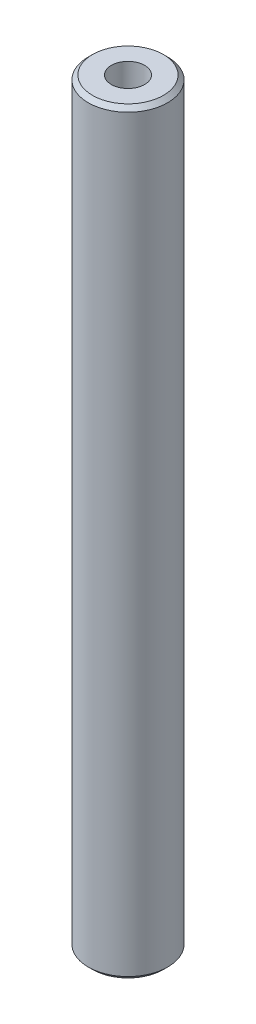
ISO-10303-21;
HEADER;
FILE_DESCRIPTION(('STEP AP214'),'2;1');
FILE_NAME('part.step','',(''),(''),'','','');
FILE_SCHEMA(('AUTOMOTIVE_DESIGN { 1 0 10303 214 1 1 1 1 }'));
ENDSEC;
DATA;
#1=APPLICATION_CONTEXT('core data for automotive mechanical design processes');
#2=APPLICATION_PROTOCOL_DEFINITION('international standard','automotive_design',2000,#1);
#3=PRODUCT_CONTEXT('',#1,'mechanical');
#4=PRODUCT('Part','Part','',(#3));
#5=PRODUCT_RELATED_PRODUCT_CATEGORY('part','',(#4));
#6=PRODUCT_DEFINITION_FORMATION('','',#4);
#7=PRODUCT_DEFINITION_CONTEXT('part definition',#1,'design');
#8=PRODUCT_DEFINITION('design','',#6,#7);
#9=PRODUCT_DEFINITION_SHAPE('','',#8);
#10=(LENGTH_UNIT() NAMED_UNIT(*) SI_UNIT(.MILLI.,.METRE.));
#11=(NAMED_UNIT(*) PLANE_ANGLE_UNIT() SI_UNIT($,.RADIAN.));
#12=(NAMED_UNIT(*) SI_UNIT($,.STERADIAN.) SOLID_ANGLE_UNIT());
#13=UNCERTAINTY_MEASURE_WITH_UNIT(LENGTH_MEASURE(1.E-05),#10,'distance_accuracy_value','');
#14=(GEOMETRIC_REPRESENTATION_CONTEXT(3) GLOBAL_UNCERTAINTY_ASSIGNED_CONTEXT((#13)) GLOBAL_UNIT_ASSIGNED_CONTEXT((#10,
#11,#12)) REPRESENTATION_CONTEXT('',''));
#15=CARTESIAN_POINT('',(0.,0.,0.));
#16=DIRECTION('',(0.,0.,1.));
#17=DIRECTION('',(1.,0.,0.));
#18=AXIS2_PLACEMENT_3D('',#15,#16,#17);
#19=CARTESIAN_POINT('',(0.,190.707714154887,0.));
#20=DIRECTION('',(0.,-1.,0.));
#21=DIRECTION('',(0.,0.,-1.));
#22=AXIS2_PLACEMENT_3D('',#19,#20,#21);
#23=CYLINDRICAL_SURFACE('',#22,10.);
#24=CARTESIAN_POINT('',(0.,189.637403917708,0.));
#25=DIRECTION('',(0.,1.,0.));
#26=DIRECTION('',(0.,0.,1.));
#27=AXIS2_PLACEMENT_3D('',#24,#25,#26);
#28=CIRCLE('',#27,10.);
#29=CARTESIAN_POINT('',(0.,189.637403917708,10.));
#30=VERTEX_POINT('',#29);
#31=EDGE_CURVE('E50',#30,#30,#28,.F.);
#32=ORIENTED_EDGE('',*,*,#31,.T.);
#33=EDGE_LOOP('',(#32));
#34=FACE_BOUND('',#33,.T.);
#35=CARTESIAN_POINT('',(0.,1.07031023717846,0.));
#36=DIRECTION('',(0.,1.,0.));
#37=DIRECTION('',(0.,0.,1.));
#38=AXIS2_PLACEMENT_3D('',#35,#36,#37);
#39=CIRCLE('',#38,10.);
#40=CARTESIAN_POINT('',(0.,1.07031023717846,10.));
#41=VERTEX_POINT('',#40);
#42=EDGE_CURVE('E51',#41,#41,#39,.T.);
#43=ORIENTED_EDGE('',*,*,#42,.T.);
#44=EDGE_LOOP('',(#43));
#45=FACE_BOUND('',#44,.T.);
#46=ADVANCED_FACE('F39',(#34,#45),#23,.T.);
#47=CARTESIAN_POINT('',(0.,190.707714154887,0.));
#48=DIRECTION('',(0.,1.,0.));
#49=DIRECTION('',(0.,0.,1.));
#50=AXIS2_PLACEMENT_3D('',#47,#48,#49);
#51=PLANE('',#50);
#52=CARTESIAN_POINT('',(0.,190.707714154887,0.));
#53=DIRECTION('',(0.,1.,0.));
#54=DIRECTION('',(0.,0.,1.));
#55=AXIS2_PLACEMENT_3D('',#52,#53,#54);
#56=CIRCLE('',#55,8.92968976282157);
#57=CARTESIAN_POINT('',(0.,190.707714154887,8.92968976282157));
#58=VERTEX_POINT('',#57);
#59=EDGE_CURVE('E54',#58,#58,#56,.T.);
#60=ORIENTED_EDGE('',*,*,#59,.T.);
#61=EDGE_LOOP('',(#60));
#62=FACE_BOUND('',#61,.T.);
#63=CARTESIAN_POINT('',(0.,190.707714154887,0.));
#64=DIRECTION('',(0.,1.,0.));
#65=DIRECTION('',(0.,0.,1.));
#66=AXIS2_PLACEMENT_3D('',#63,#64,#65);
#67=CIRCLE('',#66,4.19323574440019);
#68=CARTESIAN_POINT('',(0.,190.707714154887,4.19323574440019));
#69=VERTEX_POINT('',#68);
#70=EDGE_CURVE('E58',#69,#69,#67,.T.);
#71=ORIENTED_EDGE('',*,*,#70,.F.);
#72=EDGE_LOOP('',(#71));
#73=FACE_BOUND('',#72,.T.);
#74=ADVANCED_FACE('F69',(#62,#73),#51,.T.);
#75=CARTESIAN_POINT('',(0.,0.,0.));
#76=DIRECTION('',(0.,1.,0.));
#77=DIRECTION('',(0.,0.,1.));
#78=AXIS2_PLACEMENT_3D('',#75,#76,#77);
#79=PLANE('',#78);
#80=CARTESIAN_POINT('',(0.,0.,0.));
#81=DIRECTION('',(0.,1.,0.));
#82=DIRECTION('',(0.,0.,1.));
#83=AXIS2_PLACEMENT_3D('',#80,#81,#82);
#84=CIRCLE('',#83,8.92968976282152);
#85=CARTESIAN_POINT('',(0.,0.,8.92968976282152));
#86=VERTEX_POINT('',#85);
#87=EDGE_CURVE('E10',#86,#86,#84,.F.);
#88=ORIENTED_EDGE('',*,*,#87,.T.);
#89=EDGE_LOOP('',(#88));
#90=FACE_BOUND('',#89,.T.);
#91=CARTESIAN_POINT('',(0.,0.,0.));
#92=DIRECTION('',(0.,1.,0.));
#93=DIRECTION('',(0.,0.,1.));
#94=AXIS2_PLACEMENT_3D('',#91,#92,#93);
#95=CIRCLE('',#94,4.19323574440019);
#96=CARTESIAN_POINT('',(0.,0.,4.19323574440019));
#97=VERTEX_POINT('',#96);
#98=EDGE_CURVE('E63',#97,#97,#95,.T.);
#99=ORIENTED_EDGE('',*,*,#98,.T.);
#100=EDGE_LOOP('',(#99));
#101=FACE_BOUND('',#100,.T.);
#102=ADVANCED_FACE('F75',(#90,#101),#79,.F.);
#103=CARTESIAN_POINT('',(0.,190.707714154887,0.));
#104=DIRECTION('',(0.,-1.,0.));
#105=DIRECTION('',(0.,0.,-1.));
#106=AXIS2_PLACEMENT_3D('',#103,#104,#105);
#107=CYLINDRICAL_SURFACE('',#106,4.19323574440019);
#108=ORIENTED_EDGE('',*,*,#70,.T.);
#109=EDGE_LOOP('',(#108));
#110=FACE_BOUND('',#109,.T.);
#111=ORIENTED_EDGE('',*,*,#98,.F.);
#112=EDGE_LOOP('',(#111));
#113=FACE_BOUND('',#112,.T.);
#114=ADVANCED_FACE('F70',(#110,#113),#107,.F.);
#115=CARTESIAN_POINT('',(0.,190.707714154887,0.));
#116=DIRECTION('',(0.,-1.,0.));
#117=DIRECTION('',(0.,0.,-1.));
#118=AXIS2_PLACEMENT_3D('',#115,#116,#117);
#119=CONICAL_SURFACE('',#118,8.92968976282157,0.785398163397444);
#120=ORIENTED_EDGE('',*,*,#31,.F.);
#121=EDGE_LOOP('',(#120));
#122=FACE_BOUND('',#121,.T.);
#123=ORIENTED_EDGE('',*,*,#59,.F.);
#124=EDGE_LOOP('',(#123));
#125=FACE_BOUND('',#124,.T.);
#126=ADVANCED_FACE('F81',(#122,#125),#119,.T.);
#127=CARTESIAN_POINT('',(0.,1.07031023717846,0.));
#128=DIRECTION('',(0.,1.,0.));
#129=DIRECTION('',(0.,0.,1.));
#130=AXIS2_PLACEMENT_3D('',#127,#128,#129);
#131=CONICAL_SURFACE('',#130,10.,0.785398163397457);
#132=CARTESIAN_POINT('',(0.,0.,8.92968976282152));
#133=CARTESIAN_POINT('',(0.,0.0111490649706086,8.94083882779213));
#134=CARTESIAN_POINT('',(0.,0.0222981299412177,8.95198789276274));
#135=CARTESIAN_POINT('',(0.,0.0445962598824358,8.97428602270396));
#136=CARTESIAN_POINT('',(0.,0.0557453248530449,8.98543508767456));
#137=CARTESIAN_POINT('',(0.,0.0780434547942627,9.00773321761578));
#138=CARTESIAN_POINT('',(0.,0.0891925197648715,9.01888228258639));
#139=CARTESIAN_POINT('',(0.,0.111490649706089,9.04118041252761));
#140=CARTESIAN_POINT('',(0.,0.122639714676698,9.05232947749822));
#141=CARTESIAN_POINT('',(0.,0.144937844617917,9.07462760743944));
#142=CARTESIAN_POINT('',(0.,0.156086909588526,9.08577667241005));
#143=CARTESIAN_POINT('',(0.,0.178385039529743,9.10807480235126));
#144=CARTESIAN_POINT('',(0.,0.189534104500352,9.11922386732187));
#145=CARTESIAN_POINT('',(0.,0.21183223444157,9.14152199726309));
#146=CARTESIAN_POINT('',(0.,0.222981299412179,9.1526710622337));
#147=CARTESIAN_POINT('',(0.,0.245279429353397,9.17496919217492));
#148=CARTESIAN_POINT('',(0.,0.256428494324006,9.18611825714553));
#149=CARTESIAN_POINT('',(0.,0.278726624265224,9.20841638708675));
#150=CARTESIAN_POINT('',(0.,0.289875689235833,9.21956545205736));
#151=CARTESIAN_POINT('',(0.,0.312173819177051,9.24186358199858));
#152=CARTESIAN_POINT('',(0.,0.32332288414766,9.25301264696918));
#153=CARTESIAN_POINT('',(0.,0.345621014088878,9.2753107769104));
#154=CARTESIAN_POINT('',(0.,0.356770079059487,9.28645984188101));
#155=CARTESIAN_POINT('',(0.,0.379068209000705,9.30875797182223));
#156=CARTESIAN_POINT('',(0.,0.390217273971314,9.31990703679284));
#157=CARTESIAN_POINT('',(0.,0.412515403912532,9.34220516673406));
#158=CARTESIAN_POINT('',(0.,0.423664468883141,9.35335423170467));
#159=CARTESIAN_POINT('',(0.,0.445962598824359,9.37565236164589));
#160=CARTESIAN_POINT('',(0.,0.457111663794968,9.3868014266165));
#161=CARTESIAN_POINT('',(0.,0.479409793736186,9.40909955655771));
#162=CARTESIAN_POINT('',(0.,0.490558858706795,9.42024862152832));
#163=CARTESIAN_POINT('',(0.,0.512856988648013,9.44254675146954));
#164=CARTESIAN_POINT('',(0.,0.524006053618622,9.45369581644015));
#165=CARTESIAN_POINT('',(0.,0.54630418355984,9.47599394638137));
#166=CARTESIAN_POINT('',(0.,0.557453248530449,9.48714301135198));
#167=CARTESIAN_POINT('',(0.,0.579751378471667,9.5094411412932));
#168=CARTESIAN_POINT('',(0.,0.590900443442276,9.5205902062638));
#169=CARTESIAN_POINT('',(0.,0.613198573383494,9.54288833620502));
#170=CARTESIAN_POINT('',(0.,0.624347638354103,9.55403740117563));
#171=CARTESIAN_POINT('',(0.,0.646645768295321,9.57633553111685));
#172=CARTESIAN_POINT('',(0.,0.65779483326593,9.58748459608746));
#173=CARTESIAN_POINT('',(0.,0.680092963207148,9.60978272602868));
#174=CARTESIAN_POINT('',(0.,0.691242028177757,9.62093179099929));
#175=CARTESIAN_POINT('',(0.,0.713540158118975,9.64322992094051));
#176=CARTESIAN_POINT('',(0.,0.724689223089584,9.65437898591111));
#177=CARTESIAN_POINT('',(0.,0.746987353030802,9.67667711585233));
#178=CARTESIAN_POINT('',(0.,0.758136418001411,9.68782618082294));
#179=CARTESIAN_POINT('',(0.,0.780434547942628,9.71012431076416));
#180=CARTESIAN_POINT('',(0.,0.791583612913237,9.72127337573477));
#181=CARTESIAN_POINT('',(0.,0.813881742854456,9.74357150567599));
#182=CARTESIAN_POINT('',(0.,0.825030807825065,9.7547205706466));
#183=CARTESIAN_POINT('',(0.,0.847328937766283,9.77701870058782));
#184=CARTESIAN_POINT('',(0.,0.858478002736891,9.78816776555843));
#185=CARTESIAN_POINT('',(0.,0.880776132678109,9.81046589549964));
#186=CARTESIAN_POINT('',(0.,0.891925197648718,9.82161496047025));
#187=CARTESIAN_POINT('',(0.,0.914223327589936,9.84391309041147));
#188=CARTESIAN_POINT('',(0.,0.925372392560545,9.85506215538208));
#189=CARTESIAN_POINT('',(0.,0.947670522501763,9.8773602853233));
#190=CARTESIAN_POINT('',(0.,0.958819587472372,9.88850935029391));
#191=CARTESIAN_POINT('',(0.,0.98111771741359,9.91080748023513));
#192=CARTESIAN_POINT('',(0.,0.992266782384199,9.92195654520574));
#193=CARTESIAN_POINT('',(0.,1.01456491232542,9.94425467514695));
#194=CARTESIAN_POINT('',(0.,1.02571397729603,9.95540374011756));
#195=CARTESIAN_POINT('',(0.,1.04801210723724,9.97770187005878));
#196=CARTESIAN_POINT('',(0.,1.05916117220785,9.98885093502939));
#197=CARTESIAN_POINT('',(0.,1.07031023717846,10.));
#198=B_SPLINE_CURVE_WITH_KNOTS('',3,(#132,#133,#134,#135,#136,#137,#138,#139,#140,#141,#142,
#143,#144,#145,#146,#147,#148,#149,#150,#151,#152,#153,#154,#155,#156,#157,#158,#159,#160,#161,
#162,#163,#164,#165,#166,#167,#168,#169,#170,#171,#172,#173,#174,#175,#176,#177,#178,#179,#180,
#181,#182,#183,#184,#185,#186,#187,#188,#189,#190,#191,#192,#193,#194,#195,#196,#197),
.UNSPECIFIED.,.F.,.F.,(4,2,2,2,2,2,2,2,2,2,2,2,2,2,2,2,2,2,2,2,2,2,2,2,2,2,2,2,2,2,2,2,4),(0.,
0.047301476667642,0.0946029533352841,0.141904430002927,0.189205906670569,0.236507383338211,
0.283808860005855,0.331110336673497,0.378411813341139,0.425713290008782,0.473014766676424,
0.520316243344066,0.567617720011709,0.614919196679351,0.662220673346995,0.709522150014637,
0.756823626682279,0.804125103349922,0.851426580017564,0.898728056685206,0.946029533352849,
0.993331010020492,1.04063248668813,1.08793396335578,1.13523544002342,1.18253691669106,
1.2298383933587,1.27713987002635,1.32444134669399,1.37174282336163,1.41904430002927,
1.46634577669692,1.51364725336456),.UNSPECIFIED.);
#199=EDGE_CURVE('BSEAM45',#86,#41,#198,.T.);
#200=ORIENTED_EDGE('',*,*,#87,.F.);
#201=ORIENTED_EDGE('',*,*,#42,.F.);
#202=ORIENTED_EDGE('',*,*,#199,.T.);
#203=ORIENTED_EDGE('',*,*,#199,.F.);
#204=EDGE_LOOP('',(#200,#202,#201,#203));
#205=FACE_BOUND('',#204,.T.);
#206=ADVANCED_FACE('F45',(#205),#131,.T.);
#207=CLOSED_SHELL('',(#46,#74,#102,#114,#126,#206));
#208=MANIFOLD_SOLID_BREP('B2',#207);
#209=ADVANCED_BREP_SHAPE_REPRESENTATION('',(#18,#208),#14);
#210=SHAPE_DEFINITION_REPRESENTATION(#9,#209);
ENDSEC;
END-ISO-10303-21;
